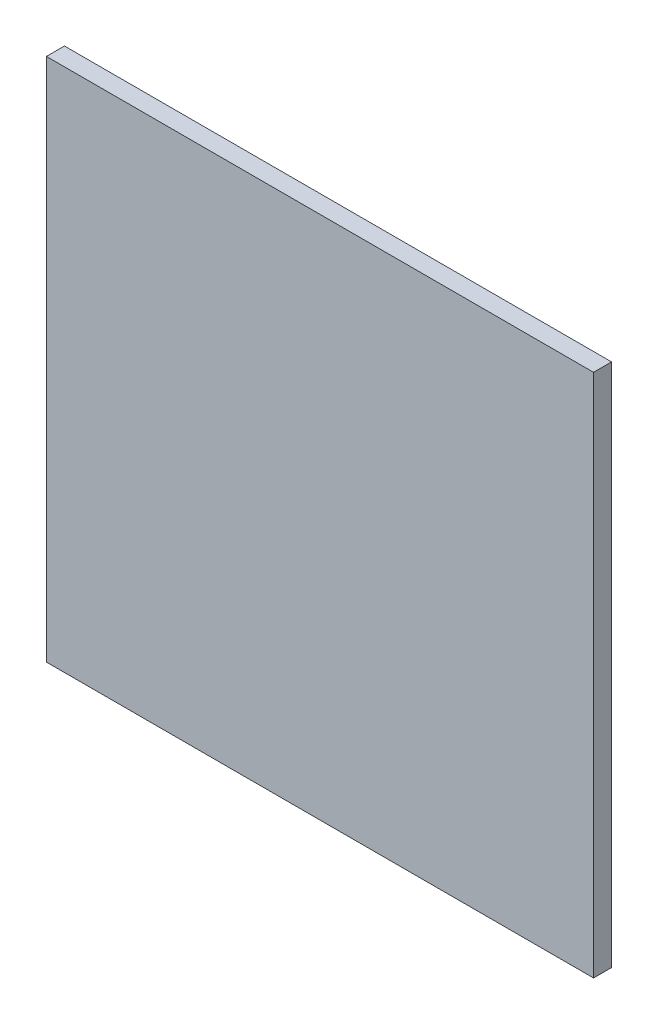
ISO-10303-21;
HEADER;
FILE_DESCRIPTION(('STEP AP214'),'2;1');
FILE_NAME('part.step','',(''),(''),'','','');
FILE_SCHEMA(('AUTOMOTIVE_DESIGN { 1 0 10303 214 1 1 1 1 }'));
ENDSEC;
DATA;
#1=APPLICATION_CONTEXT('core data for automotive mechanical design processes');
#2=APPLICATION_PROTOCOL_DEFINITION('international standard','automotive_design',2000,#1);
#3=PRODUCT_CONTEXT('',#1,'mechanical');
#4=PRODUCT('Part','Part','',(#3));
#5=PRODUCT_RELATED_PRODUCT_CATEGORY('part','',(#4));
#6=PRODUCT_DEFINITION_FORMATION('','',#4);
#7=PRODUCT_DEFINITION_CONTEXT('part definition',#1,'design');
#8=PRODUCT_DEFINITION('design','',#6,#7);
#9=PRODUCT_DEFINITION_SHAPE('','',#8);
#10=(LENGTH_UNIT() NAMED_UNIT(*) SI_UNIT(.MILLI.,.METRE.));
#11=(NAMED_UNIT(*) PLANE_ANGLE_UNIT() SI_UNIT($,.RADIAN.));
#12=(NAMED_UNIT(*) SI_UNIT($,.STERADIAN.) SOLID_ANGLE_UNIT());
#13=UNCERTAINTY_MEASURE_WITH_UNIT(LENGTH_MEASURE(1.E-05),#10,'distance_accuracy_value','');
#14=(GEOMETRIC_REPRESENTATION_CONTEXT(3) GLOBAL_UNCERTAINTY_ASSIGNED_CONTEXT((#13)) GLOBAL_UNIT_ASSIGNED_CONTEXT((#10,
#11,#12)) REPRESENTATION_CONTEXT('',''));
#15=CARTESIAN_POINT('',(0.,0.,0.));
#16=DIRECTION('',(0.,0.,1.));
#17=DIRECTION('',(1.,0.,0.));
#18=AXIS2_PLACEMENT_3D('',#15,#16,#17);
#19=CARTESIAN_POINT('',(-5.18353691573431,82.199996948242,-0.999999999999998));
#20=DIRECTION('',(-1.,0.,0.));
#21=DIRECTION('',(0.,-1.,0.));
#22=AXIS2_PLACEMENT_3D('',#19,#20,#21);
#23=PLANE('',#22);
#24=DIRECTION('',(0.,0.,1.));
#25=VECTOR('',#24,1.);
#26=CARTESIAN_POINT('',(-5.1835369157343,-5.04429616297652,-0.999999999999998));
#27=LINE('',#26,#25);
#28=CARTESIAN_POINT('',(-5.1835369157343,-5.04429616297652,-0.999999999999998));
#29=VERTEX_POINT('',#28);
#30=CARTESIAN_POINT('',(-5.1835369157343,-5.04429616297652,2.));
#31=VERTEX_POINT('',#30);
#32=EDGE_CURVE('E38',#29,#31,#27,.T.);
#33=ORIENTED_EDGE('',*,*,#32,.T.);
#34=DIRECTION('',(0.,-1.,0.));
#35=VECTOR('',#34,1.);
#36=CARTESIAN_POINT('',(-5.18353691573431,82.199996948242,2.));
#37=LINE('',#36,#35);
#38=CARTESIAN_POINT('',(-5.18353691573431,82.199996948242,2.));
#39=VERTEX_POINT('',#38);
#40=EDGE_CURVE('E75',#39,#31,#37,.T.);
#41=ORIENTED_EDGE('',*,*,#40,.F.);
#42=DIRECTION('',(0.,0.,1.));
#43=VECTOR('',#42,1.);
#44=CARTESIAN_POINT('',(-5.18353691573431,82.199996948242,-0.999999999999998));
#45=LINE('',#44,#43);
#46=CARTESIAN_POINT('',(-5.18353691573431,82.199996948242,-0.999999999999998));
#47=VERTEX_POINT('',#46);
#48=EDGE_CURVE('E11',#47,#39,#45,.T.);
#49=ORIENTED_EDGE('',*,*,#48,.F.);
#50=DIRECTION('',(0.,-1.,0.));
#51=VECTOR('',#50,1.);
#52=CARTESIAN_POINT('',(-5.18353691573431,82.199996948242,-0.999999999999998));
#53=LINE('',#52,#51);
#54=EDGE_CURVE('E76',#47,#29,#53,.T.);
#55=ORIENTED_EDGE('',*,*,#54,.T.);
#56=EDGE_LOOP('',(#33,#41,#49,#55));
#57=FACE_BOUND('',#56,.T.);
#58=ADVANCED_FACE('F35',(#57),#23,.T.);
#59=CARTESIAN_POINT('',(-5.18353691573431,82.199996948242,-0.999999999999998));
#60=DIRECTION('',(0.,1.,0.));
#61=DIRECTION('',(0.,0.,1.));
#62=AXIS2_PLACEMENT_3D('',#59,#60,#61);
#63=PLANE('',#62);
#64=ORIENTED_EDGE('',*,*,#48,.T.);
#65=DIRECTION('',(-1.,0.,0.));
#66=VECTOR('',#65,1.);
#67=CARTESIAN_POINT('',(-5.18353691573431,82.199996948242,2.));
#68=LINE('',#67,#66);
#69=CARTESIAN_POINT('',(85.8164630842657,82.199996948242,2.));
#70=VERTEX_POINT('',#69);
#71=EDGE_CURVE('E92',#70,#39,#68,.T.);
#72=ORIENTED_EDGE('',*,*,#71,.F.);
#73=DIRECTION('',(0.,0.,1.));
#74=VECTOR('',#73,1.);
#75=CARTESIAN_POINT('',(85.8164630842657,82.199996948242,-0.999999999999998));
#76=LINE('',#75,#74);
#77=CARTESIAN_POINT('',(85.8164630842657,82.199996948242,-0.999999999999998));
#78=VERTEX_POINT('',#77);
#79=EDGE_CURVE('E43',#78,#70,#76,.T.);
#80=ORIENTED_EDGE('',*,*,#79,.F.);
#81=DIRECTION('',(-1.,0.,0.));
#82=VECTOR('',#81,1.);
#83=CARTESIAN_POINT('',(-5.18353691573431,82.199996948242,-0.999999999999998));
#84=LINE('',#83,#82);
#85=EDGE_CURVE('E81',#78,#47,#84,.T.);
#86=ORIENTED_EDGE('',*,*,#85,.T.);
#87=EDGE_LOOP('',(#64,#72,#80,#86));
#88=FACE_BOUND('',#87,.T.);
#89=ADVANCED_FACE('F107',(#88),#63,.T.);
#90=CARTESIAN_POINT('',(85.8164630842657,82.199996948242,-0.999999999999998));
#91=DIRECTION('',(1.,0.,0.));
#92=DIRECTION('',(0.,1.,0.));
#93=AXIS2_PLACEMENT_3D('',#90,#91,#92);
#94=PLANE('',#93);
#95=ORIENTED_EDGE('',*,*,#79,.T.);
#96=DIRECTION('',(0.,1.,0.));
#97=VECTOR('',#96,1.);
#98=CARTESIAN_POINT('',(85.8164630842657,82.199996948242,2.));
#99=LINE('',#98,#97);
#100=CARTESIAN_POINT('',(85.8164630842657,-5.04429616297652,2.));
#101=VERTEX_POINT('',#100);
#102=EDGE_CURVE('E88',#101,#70,#99,.T.);
#103=ORIENTED_EDGE('',*,*,#102,.F.);
#104=DIRECTION('',(0.,0.,1.));
#105=VECTOR('',#104,1.);
#106=CARTESIAN_POINT('',(85.8164630842657,-5.04429616297652,-0.999999999999998));
#107=LINE('',#106,#105);
#108=CARTESIAN_POINT('',(85.8164630842657,-5.04429616297652,-0.999999999999998));
#109=VERTEX_POINT('',#108);
#110=EDGE_CURVE('E80',#109,#101,#107,.T.);
#111=ORIENTED_EDGE('',*,*,#110,.F.);
#112=DIRECTION('',(0.,1.,0.));
#113=VECTOR('',#112,1.);
#114=CARTESIAN_POINT('',(85.8164630842657,82.199996948242,-0.999999999999998));
#115=LINE('',#114,#113);
#116=EDGE_CURVE('E100',#109,#78,#115,.T.);
#117=ORIENTED_EDGE('',*,*,#116,.T.);
#118=EDGE_LOOP('',(#95,#103,#111,#117));
#119=FACE_BOUND('',#118,.T.);
#120=ADVANCED_FACE('F104',(#119),#94,.T.);
#121=CARTESIAN_POINT('',(-5.1835369157343,-5.04429616297652,-0.999999999999998));
#122=DIRECTION('',(0.,-1.,0.));
#123=DIRECTION('',(0.,0.,-1.));
#124=AXIS2_PLACEMENT_3D('',#121,#122,#123);
#125=PLANE('',#124);
#126=ORIENTED_EDGE('',*,*,#110,.T.);
#127=DIRECTION('',(1.,0.,0.));
#128=VECTOR('',#127,1.);
#129=CARTESIAN_POINT('',(-5.1835369157343,-5.04429616297652,2.));
#130=LINE('',#129,#128);
#131=EDGE_CURVE('E83',#31,#101,#130,.T.);
#132=ORIENTED_EDGE('',*,*,#131,.F.);
#133=ORIENTED_EDGE('',*,*,#32,.F.);
#134=DIRECTION('',(1.,0.,0.));
#135=VECTOR('',#134,1.);
#136=CARTESIAN_POINT('',(-5.1835369157343,-5.04429616297652,-0.999999999999998));
#137=LINE('',#136,#135);
#138=EDGE_CURVE('E98',#29,#109,#137,.T.);
#139=ORIENTED_EDGE('',*,*,#138,.T.);
#140=EDGE_LOOP('',(#126,#132,#133,#139));
#141=FACE_BOUND('',#140,.T.);
#142=ADVANCED_FACE('F84',(#141),#125,.T.);
#143=CARTESIAN_POINT('',(0.,0.,-0.999999999999998));
#144=DIRECTION('',(0.,0.,1.));
#145=DIRECTION('',(1.,0.,0.));
#146=AXIS2_PLACEMENT_3D('',#143,#144,#145);
#147=PLANE('',#146);
#148=ORIENTED_EDGE('',*,*,#54,.F.);
#149=ORIENTED_EDGE('',*,*,#85,.F.);
#150=ORIENTED_EDGE('',*,*,#116,.F.);
#151=ORIENTED_EDGE('',*,*,#138,.F.);
#152=EDGE_LOOP('',(#148,#149,#150,#151));
#153=FACE_BOUND('',#152,.T.);
#154=ADVANCED_FACE('F109',(#153),#147,.F.);
#155=CARTESIAN_POINT('',(0.,0.,2.));
#156=DIRECTION('',(0.,0.,1.));
#157=DIRECTION('',(1.,0.,0.));
#158=AXIS2_PLACEMENT_3D('',#155,#156,#157);
#159=PLANE('',#158);
#160=ORIENTED_EDGE('',*,*,#40,.T.);
#161=ORIENTED_EDGE('',*,*,#131,.T.);
#162=ORIENTED_EDGE('',*,*,#102,.T.);
#163=ORIENTED_EDGE('',*,*,#71,.T.);
#164=EDGE_LOOP('',(#160,#161,#162,#163));
#165=FACE_BOUND('',#164,.T.);
#166=ADVANCED_FACE('F91',(#165),#159,.T.);
#167=CLOSED_SHELL('',(#58,#89,#120,#142,#154,#166));
#168=MANIFOLD_SOLID_BREP('B2',#167);
#169=ADVANCED_BREP_SHAPE_REPRESENTATION('',(#18,#168),#14);
#170=SHAPE_DEFINITION_REPRESENTATION(#9,#169);
ENDSEC;
END-ISO-10303-21;
